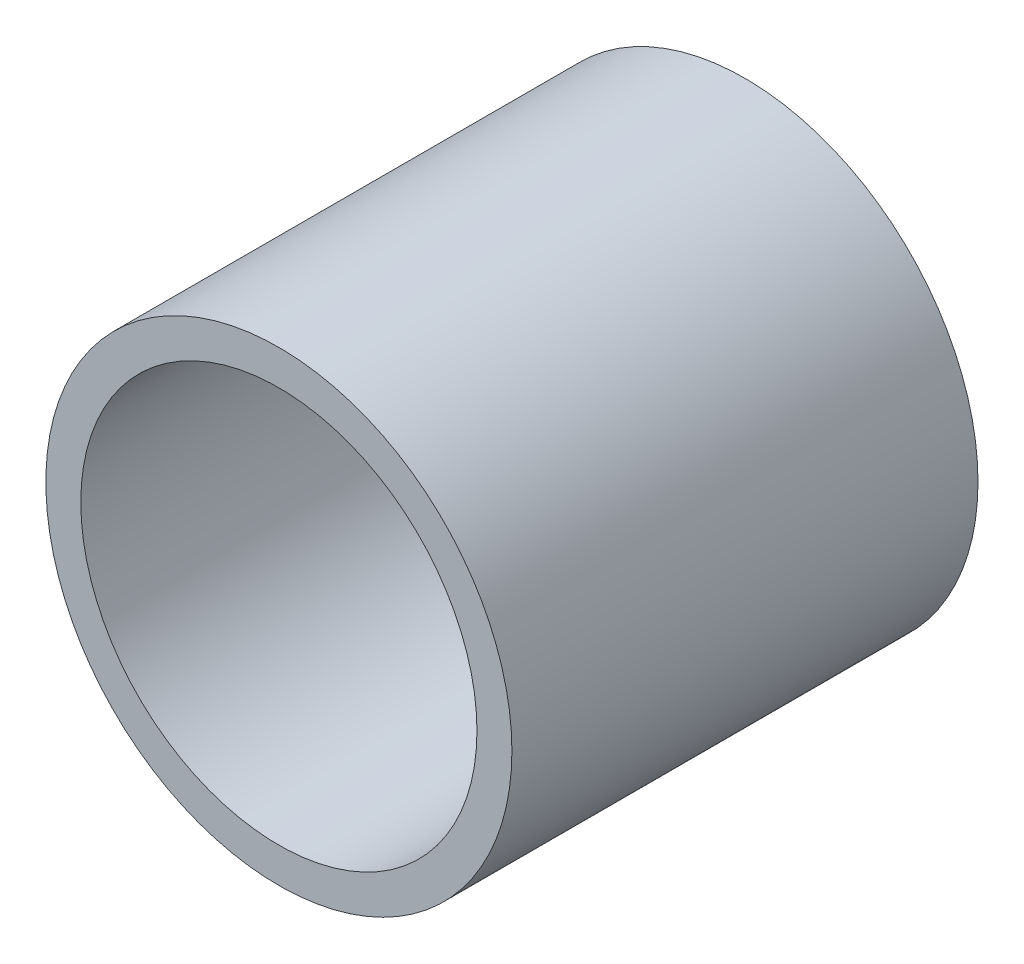
ISO-10303-21;
HEADER;
FILE_DESCRIPTION(('STEP AP214'),'2;1');
FILE_NAME('part.step','',(''),(''),'','','');
FILE_SCHEMA(('AUTOMOTIVE_DESIGN { 1 0 10303 214 1 1 1 1 }'));
ENDSEC;
DATA;
#1=APPLICATION_CONTEXT('core data for automotive mechanical design processes');
#2=APPLICATION_PROTOCOL_DEFINITION('international standard','automotive_design',2000,#1);
#3=PRODUCT_CONTEXT('',#1,'mechanical');
#4=PRODUCT('Part','Part','',(#3));
#5=PRODUCT_RELATED_PRODUCT_CATEGORY('part','',(#4));
#6=PRODUCT_DEFINITION_FORMATION('','',#4);
#7=PRODUCT_DEFINITION_CONTEXT('part definition',#1,'design');
#8=PRODUCT_DEFINITION('design','',#6,#7);
#9=PRODUCT_DEFINITION_SHAPE('','',#8);
#10=(LENGTH_UNIT() NAMED_UNIT(*) SI_UNIT(.MILLI.,.METRE.));
#11=(NAMED_UNIT(*) PLANE_ANGLE_UNIT() SI_UNIT($,.RADIAN.));
#12=(NAMED_UNIT(*) SI_UNIT($,.STERADIAN.) SOLID_ANGLE_UNIT());
#13=UNCERTAINTY_MEASURE_WITH_UNIT(LENGTH_MEASURE(1.E-05),#10,'distance_accuracy_value','');
#14=(GEOMETRIC_REPRESENTATION_CONTEXT(3) GLOBAL_UNCERTAINTY_ASSIGNED_CONTEXT((#13)) GLOBAL_UNIT_ASSIGNED_CONTEXT((#10,
#11,#12)) REPRESENTATION_CONTEXT('',''));
#15=CARTESIAN_POINT('',(0.,0.,0.));
#16=DIRECTION('',(0.,0.,1.));
#17=DIRECTION('',(1.,0.,0.));
#18=AXIS2_PLACEMENT_3D('',#15,#16,#17);
#19=CARTESIAN_POINT('',(0.,0.,80.));
#20=DIRECTION('',(0.,0.,1.));
#21=DIRECTION('',(1.,0.,0.));
#22=AXIS2_PLACEMENT_3D('',#19,#20,#21);
#23=PLANE('',#22);
#24=CARTESIAN_POINT('',(0.,0.,80.));
#25=DIRECTION('',(0.,0.,1.));
#26=DIRECTION('',(1.,0.,0.));
#27=AXIS2_PLACEMENT_3D('',#24,#25,#26);
#28=CIRCLE('',#27,40.);
#29=CARTESIAN_POINT('',(40.,0.,80.));
#30=VERTEX_POINT('',#29);
#31=EDGE_CURVE('E11',#30,#30,#28,.T.);
#32=ORIENTED_EDGE('',*,*,#31,.T.);
#33=EDGE_LOOP('',(#32));
#34=FACE_BOUND('',#33,.T.);
#35=CARTESIAN_POINT('',(0.,0.,80.));
#36=DIRECTION('',(0.,0.,1.));
#37=DIRECTION('',(1.,0.,0.));
#38=AXIS2_PLACEMENT_3D('',#35,#36,#37);
#39=CIRCLE('',#38,34.);
#40=CARTESIAN_POINT('',(34.,0.,80.));
#41=VERTEX_POINT('',#40);
#42=EDGE_CURVE('E46',#41,#41,#39,.T.);
#43=ORIENTED_EDGE('',*,*,#42,.F.);
#44=EDGE_LOOP('',(#43));
#45=FACE_BOUND('',#44,.T.);
#46=ADVANCED_FACE('F35',(#34,#45),#23,.T.);
#47=CARTESIAN_POINT('',(0.,0.,0.));
#48=DIRECTION('',(0.,0.,1.));
#49=DIRECTION('',(1.,0.,0.));
#50=AXIS2_PLACEMENT_3D('',#47,#48,#49);
#51=PLANE('',#50);
#52=CARTESIAN_POINT('',(0.,0.,0.));
#53=DIRECTION('',(0.,0.,1.));
#54=DIRECTION('',(1.,0.,0.));
#55=AXIS2_PLACEMENT_3D('',#52,#53,#54);
#56=CIRCLE('',#55,40.);
#57=CARTESIAN_POINT('',(40.,0.,0.));
#58=VERTEX_POINT('',#57);
#59=EDGE_CURVE('E39',#58,#58,#56,.T.);
#60=ORIENTED_EDGE('',*,*,#59,.F.);
#61=EDGE_LOOP('',(#60));
#62=FACE_BOUND('',#61,.T.);
#63=CARTESIAN_POINT('',(0.,0.,0.));
#64=DIRECTION('',(0.,0.,1.));
#65=DIRECTION('',(1.,0.,0.));
#66=AXIS2_PLACEMENT_3D('',#63,#64,#65);
#67=CIRCLE('',#66,34.);
#68=CARTESIAN_POINT('',(34.,0.,0.));
#69=VERTEX_POINT('',#68);
#70=EDGE_CURVE('E48',#69,#69,#67,.T.);
#71=ORIENTED_EDGE('',*,*,#70,.T.);
#72=EDGE_LOOP('',(#71));
#73=FACE_BOUND('',#72,.T.);
#74=ADVANCED_FACE('F58',(#62,#73),#51,.F.);
#75=CARTESIAN_POINT('',(0.,0.,80.));
#76=DIRECTION('',(0.,0.,-1.));
#77=DIRECTION('',(-1.,0.,0.));
#78=AXIS2_PLACEMENT_3D('',#75,#76,#77);
#79=CYLINDRICAL_SURFACE('',#78,40.);
#80=ORIENTED_EDGE('',*,*,#31,.F.);
#81=EDGE_LOOP('',(#80));
#82=FACE_BOUND('',#81,.T.);
#83=ORIENTED_EDGE('',*,*,#59,.T.);
#84=EDGE_LOOP('',(#83));
#85=FACE_BOUND('',#84,.T.);
#86=ADVANCED_FACE('F37',(#82,#85),#79,.T.);
#87=CARTESIAN_POINT('',(0.,0.,80.));
#88=DIRECTION('',(0.,0.,-1.));
#89=DIRECTION('',(-1.,0.,0.));
#90=AXIS2_PLACEMENT_3D('',#87,#88,#89);
#91=CYLINDRICAL_SURFACE('',#90,34.);
#92=ORIENTED_EDGE('',*,*,#42,.T.);
#93=EDGE_LOOP('',(#92));
#94=FACE_BOUND('',#93,.T.);
#95=ORIENTED_EDGE('',*,*,#70,.F.);
#96=EDGE_LOOP('',(#95));
#97=FACE_BOUND('',#96,.T.);
#98=ADVANCED_FACE('F54',(#94,#97),#91,.F.);
#99=CLOSED_SHELL('',(#46,#74,#86,#98));
#100=MANIFOLD_SOLID_BREP('B2',#99);
#101=ADVANCED_BREP_SHAPE_REPRESENTATION('',(#18,#100),#14);
#102=SHAPE_DEFINITION_REPRESENTATION(#9,#101);
ENDSEC;
END-ISO-10303-21;
